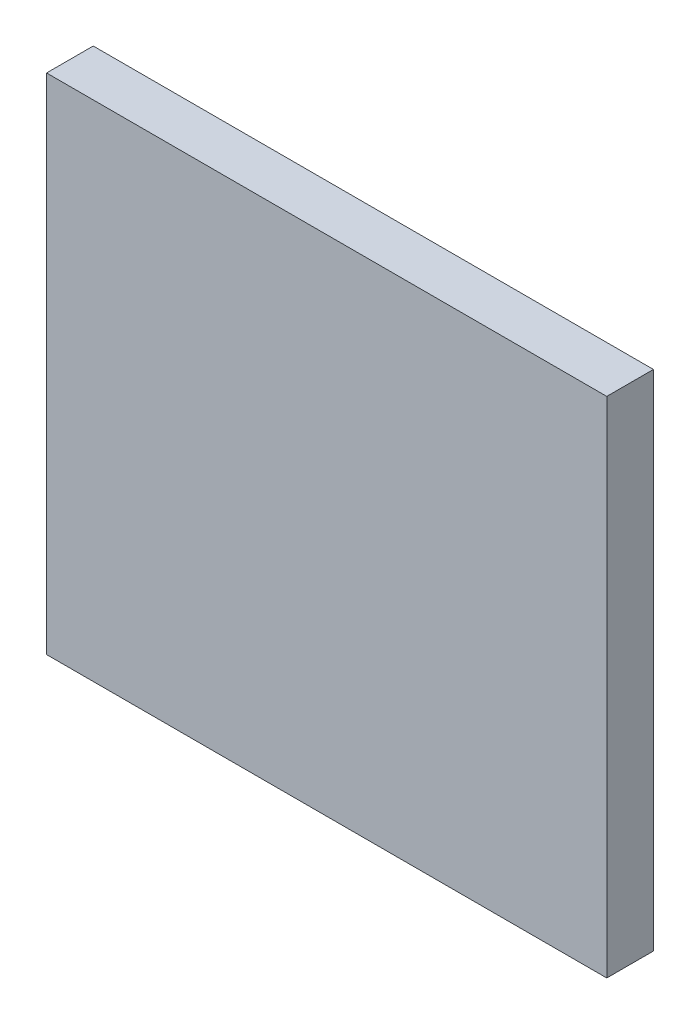
ISO-10303-21;
HEADER;
FILE_DESCRIPTION(('STEP AP214'),'2;1');
FILE_NAME('part.step','',(''),(''),'','','');
FILE_SCHEMA(('AUTOMOTIVE_DESIGN { 1 0 10303 214 1 1 1 1 }'));
ENDSEC;
DATA;
#1=APPLICATION_CONTEXT('core data for automotive mechanical design processes');
#2=APPLICATION_PROTOCOL_DEFINITION('international standard','automotive_design',2000,#1);
#3=PRODUCT_CONTEXT('',#1,'mechanical');
#4=PRODUCT('Part','Part','',(#3));
#5=PRODUCT_RELATED_PRODUCT_CATEGORY('part','',(#4));
#6=PRODUCT_DEFINITION_FORMATION('','',#4);
#7=PRODUCT_DEFINITION_CONTEXT('part definition',#1,'design');
#8=PRODUCT_DEFINITION('design','',#6,#7);
#9=PRODUCT_DEFINITION_SHAPE('','',#8);
#10=(LENGTH_UNIT() NAMED_UNIT(*) SI_UNIT(.MILLI.,.METRE.));
#11=(NAMED_UNIT(*) PLANE_ANGLE_UNIT() SI_UNIT($,.RADIAN.));
#12=(NAMED_UNIT(*) SI_UNIT($,.STERADIAN.) SOLID_ANGLE_UNIT());
#13=UNCERTAINTY_MEASURE_WITH_UNIT(LENGTH_MEASURE(1.E-05),#10,'distance_accuracy_value','');
#14=(GEOMETRIC_REPRESENTATION_CONTEXT(3) GLOBAL_UNCERTAINTY_ASSIGNED_CONTEXT((#13)) GLOBAL_UNIT_ASSIGNED_CONTEXT((#10,
#11,#12)) REPRESENTATION_CONTEXT('',''));
#15=CARTESIAN_POINT('',(0.,0.,0.));
#16=DIRECTION('',(0.,0.,1.));
#17=DIRECTION('',(1.,0.,0.));
#18=AXIS2_PLACEMENT_3D('',#15,#16,#17);
#19=CARTESIAN_POINT('',(-152.4,-53.4724,0.));
#20=DIRECTION('',(1.,0.,0.));
#21=DIRECTION('',(0.,0.,-1.));
#22=AXIS2_PLACEMENT_3D('',#19,#20,#21);
#23=PLANE('',#22);
#24=DIRECTION('',(0.,0.,1.));
#25=VECTOR('',#24,1.);
#26=CARTESIAN_POINT('',(-152.4,-190.5,0.));
#27=LINE('',#26,#25);
#28=CARTESIAN_POINT('',(-152.4,-190.5,0.));
#29=VERTEX_POINT('',#28);
#30=CARTESIAN_POINT('',(-152.4,-190.5,12.6999999999999));
#31=VERTEX_POINT('',#30);
#32=EDGE_CURVE('E146',#29,#31,#27,.T.);
#33=ORIENTED_EDGE('',*,*,#32,.T.);
#34=DIRECTION('',(0.,-1.,0.));
#35=VECTOR('',#34,1.);
#36=CARTESIAN_POINT('',(-152.4,-53.4724,12.6999999999999));
#37=LINE('',#36,#35);
#38=CARTESIAN_POINT('',(-152.4,-53.4724,12.6999999999999));
#39=VERTEX_POINT('',#38);
#40=EDGE_CURVE('E11',#39,#31,#37,.T.);
#41=ORIENTED_EDGE('',*,*,#40,.F.);
#42=DIRECTION('',(0.,0.,1.));
#43=VECTOR('',#42,1.);
#44=CARTESIAN_POINT('',(-152.4,-53.4724,0.));
#45=LINE('',#44,#43);
#46=CARTESIAN_POINT('',(-152.4,-53.4724,0.));
#47=VERTEX_POINT('',#46);
#48=EDGE_CURVE('E147',#47,#39,#45,.T.);
#49=ORIENTED_EDGE('',*,*,#48,.F.);
#50=DIRECTION('',(0.,-1.,0.));
#51=VECTOR('',#50,1.);
#52=CARTESIAN_POINT('',(-152.4,-53.4724,0.));
#53=LINE('',#52,#51);
#54=EDGE_CURVE('E153',#47,#29,#53,.T.);
#55=ORIENTED_EDGE('',*,*,#54,.T.);
#56=EDGE_LOOP('',(#33,#41,#49,#55));
#57=FACE_BOUND('',#56,.T.);
#58=ADVANCED_FACE('F35',(#57),#23,.F.);
#59=CARTESIAN_POINT('',(-152.4,-53.4724,12.6999999999999));
#60=DIRECTION('',(0.,0.,-1.));
#61=DIRECTION('',(-1.,0.,0.));
#62=AXIS2_PLACEMENT_3D('',#59,#60,#61);
#63=PLANE('',#62);
#64=DIRECTION('',(1.,0.,0.));
#65=VECTOR('',#64,1.);
#66=CARTESIAN_POINT('',(-152.4,-190.5,12.6999999999999));
#67=LINE('',#66,#65);
#68=CARTESIAN_POINT('',(1.66533453693773E-13,-190.5,12.7));
#69=VERTEX_POINT('',#68);
#70=EDGE_CURVE('E156',#31,#69,#67,.T.);
#71=ORIENTED_EDGE('',*,*,#70,.T.);
#72=DIRECTION('',(0.,-1.,0.));
#73=VECTOR('',#72,1.);
#74=CARTESIAN_POINT('',(1.66533453693773E-13,-53.4724,12.7));
#75=LINE('',#74,#73);
#76=CARTESIAN_POINT('',(1.66533453693773E-13,-53.4724,12.7));
#77=VERTEX_POINT('',#76);
#78=EDGE_CURVE('E43',#77,#69,#75,.T.);
#79=ORIENTED_EDGE('',*,*,#78,.F.);
#80=DIRECTION('',(1.,0.,0.));
#81=VECTOR('',#80,1.);
#82=CARTESIAN_POINT('',(-152.4,-53.4724,12.6999999999999));
#83=LINE('',#82,#81);
#84=EDGE_CURVE('E82',#39,#77,#83,.T.);
#85=ORIENTED_EDGE('',*,*,#84,.F.);
#86=ORIENTED_EDGE('',*,*,#40,.T.);
#87=EDGE_LOOP('',(#71,#79,#85,#86));
#88=FACE_BOUND('',#87,.T.);
#89=ADVANCED_FACE('F179',(#88),#63,.F.);
#90=CARTESIAN_POINT('',(0.,-53.4724,0.));
#91=DIRECTION('',(-1.,0.,0.));
#92=DIRECTION('',(0.,0.,1.));
#93=AXIS2_PLACEMENT_3D('',#90,#91,#92);
#94=PLANE('',#93);
#95=DIRECTION('',(0.,0.,-1.));
#96=VECTOR('',#95,1.);
#97=CARTESIAN_POINT('',(0.,-190.5,0.));
#98=LINE('',#97,#96);
#99=CARTESIAN_POINT('',(0.,-190.5,0.));
#100=VERTEX_POINT('',#99);
#101=EDGE_CURVE('E69',#69,#100,#98,.T.);
#102=ORIENTED_EDGE('',*,*,#101,.T.);
#103=DIRECTION('',(0.,-1.,0.));
#104=VECTOR('',#103,1.);
#105=CARTESIAN_POINT('',(0.,-53.4724,0.));
#106=LINE('',#105,#104);
#107=CARTESIAN_POINT('',(0.,-53.4724,0.));
#108=VERTEX_POINT('',#107);
#109=EDGE_CURVE('E161',#108,#100,#106,.T.);
#110=ORIENTED_EDGE('',*,*,#109,.F.);
#111=DIRECTION('',(0.,0.,-1.));
#112=VECTOR('',#111,1.);
#113=CARTESIAN_POINT('',(0.,-53.4724,0.));
#114=LINE('',#113,#112);
#115=EDGE_CURVE('E150',#77,#108,#114,.T.);
#116=ORIENTED_EDGE('',*,*,#115,.F.);
#117=ORIENTED_EDGE('',*,*,#78,.T.);
#118=EDGE_LOOP('',(#102,#110,#116,#117));
#119=FACE_BOUND('',#118,.T.);
#120=ADVANCED_FACE('F163',(#119),#94,.F.);
#121=CARTESIAN_POINT('',(-152.4,-53.4724,0.));
#122=DIRECTION('',(0.,0.,1.));
#123=DIRECTION('',(1.,0.,0.));
#124=AXIS2_PLACEMENT_3D('',#121,#122,#123);
#125=PLANE('',#124);
#126=DIRECTION('',(-1.,0.,0.));
#127=VECTOR('',#126,1.);
#128=CARTESIAN_POINT('',(-152.4,-190.5,0.));
#129=LINE('',#128,#127);
#130=EDGE_CURVE('E75',#100,#29,#129,.T.);
#131=ORIENTED_EDGE('',*,*,#130,.T.);
#132=ORIENTED_EDGE('',*,*,#54,.F.);
#133=DIRECTION('',(-1.,0.,0.));
#134=VECTOR('',#133,1.);
#135=CARTESIAN_POINT('',(-152.4,-53.4724,0.));
#136=LINE('',#135,#134);
#137=EDGE_CURVE('E51',#108,#47,#136,.T.);
#138=ORIENTED_EDGE('',*,*,#137,.F.);
#139=ORIENTED_EDGE('',*,*,#109,.T.);
#140=EDGE_LOOP('',(#131,#132,#138,#139));
#141=FACE_BOUND('',#140,.T.);
#142=ADVANCED_FACE('F170',(#141),#125,.F.);
#143=CARTESIAN_POINT('',(0.,-53.4724,0.));
#144=DIRECTION('',(0.,1.,0.));
#145=DIRECTION('',(0.,0.,1.));
#146=AXIS2_PLACEMENT_3D('',#143,#144,#145);
#147=PLANE('',#146);
#148=ORIENTED_EDGE('',*,*,#48,.T.);
#149=ORIENTED_EDGE('',*,*,#84,.T.);
#150=ORIENTED_EDGE('',*,*,#115,.T.);
#151=ORIENTED_EDGE('',*,*,#137,.T.);
#152=EDGE_LOOP('',(#148,#149,#150,#151));
#153=FACE_BOUND('',#152,.T.);
#154=ADVANCED_FACE('F172',(#153),#147,.T.);
#155=CARTESIAN_POINT('',(0.,-190.5,0.));
#156=DIRECTION('',(0.,1.,0.));
#157=DIRECTION('',(0.,0.,1.));
#158=AXIS2_PLACEMENT_3D('',#155,#156,#157);
#159=PLANE('',#158);
#160=CARTESIAN_POINT('',(-139.7,-190.5,6.34999999999997));
#161=DIRECTION('',(0.,-1.,0.));
#162=DIRECTION('',(0.,0.,-1.));
#163=AXIS2_PLACEMENT_3D('',#160,#161,#162);
#164=CIRCLE('',#163,2.55269999999999);
#165=CARTESIAN_POINT('',(-139.7,-190.5,3.79729999999998));
#166=VERTEX_POINT('',#165);
#167=EDGE_CURVE('E112',#166,#166,#164,.T.);
#168=ORIENTED_EDGE('',*,*,#167,.F.);
#169=EDGE_LOOP('',(#168));
#170=FACE_BOUND('',#169,.T.);
#171=CARTESIAN_POINT('',(-114.3,-190.5,6.35000000000014));
#172=DIRECTION('',(0.,-1.,0.));
#173=DIRECTION('',(0.,0.,-1.));
#174=AXIS2_PLACEMENT_3D('',#171,#172,#173);
#175=CIRCLE('',#174,2.55269999999999);
#176=CARTESIAN_POINT('',(-114.3,-190.5,3.79730000000015));
#177=VERTEX_POINT('',#176);
#178=EDGE_CURVE('E111',#177,#177,#175,.T.);
#179=ORIENTED_EDGE('',*,*,#178,.F.);
#180=EDGE_LOOP('',(#179));
#181=FACE_BOUND('',#180,.T.);
#182=CARTESIAN_POINT('',(-88.9,-190.5,6.35000000000032));
#183=DIRECTION('',(0.,-1.,0.));
#184=DIRECTION('',(0.,0.,-1.));
#185=AXIS2_PLACEMENT_3D('',#182,#183,#184);
#186=CIRCLE('',#185,2.55269999999999);
#187=CARTESIAN_POINT('',(-88.9,-190.5,3.79730000000033));
#188=VERTEX_POINT('',#187);
#189=EDGE_CURVE('E122',#188,#188,#186,.T.);
#190=ORIENTED_EDGE('',*,*,#189,.F.);
#191=EDGE_LOOP('',(#190));
#192=FACE_BOUND('',#191,.T.);
#193=CARTESIAN_POINT('',(-63.5,-190.5,6.3500000000005));
#194=DIRECTION('',(0.,-1.,0.));
#195=DIRECTION('',(0.,0.,-1.));
#196=AXIS2_PLACEMENT_3D('',#193,#194,#195);
#197=CIRCLE('',#196,2.55269999999999);
#198=CARTESIAN_POINT('',(-63.5,-190.5,3.79730000000051));
#199=VERTEX_POINT('',#198);
#200=EDGE_CURVE('E128',#199,#199,#197,.T.);
#201=ORIENTED_EDGE('',*,*,#200,.F.);
#202=EDGE_LOOP('',(#201));
#203=FACE_BOUND('',#202,.T.);
#204=CARTESIAN_POINT('',(-38.1,-190.5,6.35000000000068));
#205=DIRECTION('',(0.,-1.,0.));
#206=DIRECTION('',(0.,0.,-1.));
#207=AXIS2_PLACEMENT_3D('',#204,#205,#206);
#208=CIRCLE('',#207,2.55269999999999);
#209=CARTESIAN_POINT('',(-38.1,-190.5,3.79730000000069));
#210=VERTEX_POINT('',#209);
#211=EDGE_CURVE('E134',#210,#210,#208,.T.);
#212=ORIENTED_EDGE('',*,*,#211,.F.);
#213=EDGE_LOOP('',(#212));
#214=FACE_BOUND('',#213,.T.);
#215=CARTESIAN_POINT('',(-12.7,-190.5,6.35000000000085));
#216=DIRECTION('',(0.,-1.,0.));
#217=DIRECTION('',(0.,0.,-1.));
#218=AXIS2_PLACEMENT_3D('',#215,#216,#217);
#219=CIRCLE('',#218,2.55269999999999);
#220=CARTESIAN_POINT('',(-12.7,-190.5,3.79730000000086));
#221=VERTEX_POINT('',#220);
#222=EDGE_CURVE('E140',#221,#221,#219,.T.);
#223=ORIENTED_EDGE('',*,*,#222,.F.);
#224=EDGE_LOOP('',(#223));
#225=FACE_BOUND('',#224,.T.);
#226=ORIENTED_EDGE('',*,*,#32,.F.);
#227=ORIENTED_EDGE('',*,*,#130,.F.);
#228=ORIENTED_EDGE('',*,*,#101,.F.);
#229=ORIENTED_EDGE('',*,*,#70,.F.);
#230=EDGE_LOOP('',(#226,#227,#228,#229));
#231=FACE_BOUND('',#230,.T.);
#232=ADVANCED_FACE('F166',(#170,#181,#192,#203,#214,#225,#231),#159,.F.);
#233=CARTESIAN_POINT('',(-12.7,-170.5,6.35000000000085));
#234=DIRECTION('',(0.,-1.,0.));
#235=DIRECTION('',(0.,0.,-1.));
#236=AXIS2_PLACEMENT_3D('',#233,#234,#235);
#237=CONICAL_SURFACE('',#236,2.5527,1.02974425867665);
#238=CARTESIAN_POINT('',(-12.7,-168.966183097808,6.35000000000085));
#239=VERTEX_POINT('',#238);
#240=VERTEX_LOOP('',#239);
#241=FACE_BOUND('',#240,.T.);
#242=CARTESIAN_POINT('',(-12.7,-170.5,6.35000000000085));
#243=DIRECTION('',(0.,-1.,0.));
#244=DIRECTION('',(0.,0.,-1.));
#245=AXIS2_PLACEMENT_3D('',#242,#243,#244);
#246=CIRCLE('',#245,2.5527);
#247=CARTESIAN_POINT('',(-12.7,-170.5,3.79730000000086));
#248=VERTEX_POINT('',#247);
#249=EDGE_CURVE('E143',#248,#248,#246,.T.);
#250=ORIENTED_EDGE('',*,*,#249,.T.);
#251=EDGE_LOOP('',(#250));
#252=FACE_BOUND('',#251,.T.);
#253=ADVANCED_FACE('F211',(#241,#252),#237,.F.);
#254=CARTESIAN_POINT('',(-12.7,-190.5,6.35000000000085));
#255=DIRECTION('',(0.,-1.,0.));
#256=DIRECTION('',(0.,0.,-1.));
#257=AXIS2_PLACEMENT_3D('',#254,#255,#256);
#258=CYLINDRICAL_SURFACE('',#257,2.55269999999999);
#259=ORIENTED_EDGE('',*,*,#249,.F.);
#260=EDGE_LOOP('',(#259));
#261=FACE_BOUND('',#260,.T.);
#262=ORIENTED_EDGE('',*,*,#222,.T.);
#263=EDGE_LOOP('',(#262));
#264=FACE_BOUND('',#263,.T.);
#265=ADVANCED_FACE('F220',(#261,#264),#258,.F.);
#266=CARTESIAN_POINT('',(-38.1,-170.5,6.35000000000068));
#267=DIRECTION('',(0.,-1.,0.));
#268=DIRECTION('',(0.,0.,-1.));
#269=AXIS2_PLACEMENT_3D('',#266,#267,#268);
#270=CONICAL_SURFACE('',#269,2.5527,1.02974425867665);
#271=CARTESIAN_POINT('',(-38.1,-168.966183097808,6.35000000000068));
#272=VERTEX_POINT('',#271);
#273=VERTEX_LOOP('',#272);
#274=FACE_BOUND('',#273,.T.);
#275=CARTESIAN_POINT('',(-38.1,-170.5,6.35000000000068));
#276=DIRECTION('',(0.,-1.,0.));
#277=DIRECTION('',(0.,0.,-1.));
#278=AXIS2_PLACEMENT_3D('',#275,#276,#277);
#279=CIRCLE('',#278,2.5527);
#280=CARTESIAN_POINT('',(-38.1,-170.5,3.79730000000068));
#281=VERTEX_POINT('',#280);
#282=EDGE_CURVE('E137',#281,#281,#279,.T.);
#283=ORIENTED_EDGE('',*,*,#282,.T.);
#284=EDGE_LOOP('',(#283));
#285=FACE_BOUND('',#284,.T.);
#286=ADVANCED_FACE('F230',(#274,#285),#270,.F.);
#287=CARTESIAN_POINT('',(-38.1,-190.5,6.35000000000068));
#288=DIRECTION('',(0.,-1.,0.));
#289=DIRECTION('',(0.,0.,-1.));
#290=AXIS2_PLACEMENT_3D('',#287,#288,#289);
#291=CYLINDRICAL_SURFACE('',#290,2.55269999999999);
#292=ORIENTED_EDGE('',*,*,#282,.F.);
#293=EDGE_LOOP('',(#292));
#294=FACE_BOUND('',#293,.T.);
#295=ORIENTED_EDGE('',*,*,#211,.T.);
#296=EDGE_LOOP('',(#295));
#297=FACE_BOUND('',#296,.T.);
#298=ADVANCED_FACE('F240',(#294,#297),#291,.F.);
#299=CARTESIAN_POINT('',(-63.5,-170.5,6.3500000000005));
#300=DIRECTION('',(0.,-1.,0.));
#301=DIRECTION('',(0.,0.,-1.));
#302=AXIS2_PLACEMENT_3D('',#299,#300,#301);
#303=CONICAL_SURFACE('',#302,2.5527,1.02974425867665);
#304=CARTESIAN_POINT('',(-63.5,-168.966183097808,6.3500000000005));
#305=VERTEX_POINT('',#304);
#306=VERTEX_LOOP('',#305);
#307=FACE_BOUND('',#306,.T.);
#308=CARTESIAN_POINT('',(-63.5,-170.5,6.3500000000005));
#309=DIRECTION('',(0.,-1.,0.));
#310=DIRECTION('',(0.,0.,-1.));
#311=AXIS2_PLACEMENT_3D('',#308,#309,#310);
#312=CIRCLE('',#311,2.5527);
#313=CARTESIAN_POINT('',(-63.5,-170.5,3.7973000000005));
#314=VERTEX_POINT('',#313);
#315=EDGE_CURVE('E131',#314,#314,#312,.T.);
#316=ORIENTED_EDGE('',*,*,#315,.T.);
#317=EDGE_LOOP('',(#316));
#318=FACE_BOUND('',#317,.T.);
#319=ADVANCED_FACE('F250',(#307,#318),#303,.F.);
#320=CARTESIAN_POINT('',(-63.5,-190.5,6.3500000000005));
#321=DIRECTION('',(0.,-1.,0.));
#322=DIRECTION('',(0.,0.,-1.));
#323=AXIS2_PLACEMENT_3D('',#320,#321,#322);
#324=CYLINDRICAL_SURFACE('',#323,2.55269999999999);
#325=ORIENTED_EDGE('',*,*,#315,.F.);
#326=EDGE_LOOP('',(#325));
#327=FACE_BOUND('',#326,.T.);
#328=ORIENTED_EDGE('',*,*,#200,.T.);
#329=EDGE_LOOP('',(#328));
#330=FACE_BOUND('',#329,.T.);
#331=ADVANCED_FACE('F260',(#327,#330),#324,.F.);
#332=CARTESIAN_POINT('',(-88.9,-170.5,6.35000000000032));
#333=DIRECTION('',(0.,-1.,0.));
#334=DIRECTION('',(0.,0.,-1.));
#335=AXIS2_PLACEMENT_3D('',#332,#333,#334);
#336=CONICAL_SURFACE('',#335,2.55269999999999,1.02974425867665);
#337=CARTESIAN_POINT('',(-88.9,-168.966183097808,6.35000000000032));
#338=VERTEX_POINT('',#337);
#339=VERTEX_LOOP('',#338);
#340=FACE_BOUND('',#339,.T.);
#341=CARTESIAN_POINT('',(-88.9,-170.5,6.35000000000032));
#342=DIRECTION('',(0.,-1.,0.));
#343=DIRECTION('',(0.,0.,-1.));
#344=AXIS2_PLACEMENT_3D('',#341,#342,#343);
#345=CIRCLE('',#344,2.55269999999999);
#346=CARTESIAN_POINT('',(-88.9,-170.5,3.79730000000033));
#347=VERTEX_POINT('',#346);
#348=EDGE_CURVE('E125',#347,#347,#345,.T.);
#349=ORIENTED_EDGE('',*,*,#348,.T.);
#350=EDGE_LOOP('',(#349));
#351=FACE_BOUND('',#350,.T.);
#352=ADVANCED_FACE('F270',(#340,#351),#336,.F.);
#353=CARTESIAN_POINT('',(-88.9,-190.5,6.35000000000032));
#354=DIRECTION('',(0.,-1.,0.));
#355=DIRECTION('',(0.,0.,-1.));
#356=AXIS2_PLACEMENT_3D('',#353,#354,#355);
#357=CYLINDRICAL_SURFACE('',#356,2.55269999999999);
#358=ORIENTED_EDGE('',*,*,#348,.F.);
#359=EDGE_LOOP('',(#358));
#360=FACE_BOUND('',#359,.T.);
#361=ORIENTED_EDGE('',*,*,#189,.T.);
#362=EDGE_LOOP('',(#361));
#363=FACE_BOUND('',#362,.T.);
#364=ADVANCED_FACE('F280',(#360,#363),#357,.F.);
#365=CARTESIAN_POINT('',(-114.3,-170.5,6.35000000000014));
#366=DIRECTION('',(0.,-1.,0.));
#367=DIRECTION('',(0.,0.,-1.));
#368=AXIS2_PLACEMENT_3D('',#365,#366,#367);
#369=CONICAL_SURFACE('',#368,2.55269999999999,1.02974425867665);
#370=CARTESIAN_POINT('',(-114.3,-168.966183097808,6.35000000000014));
#371=VERTEX_POINT('',#370);
#372=VERTEX_LOOP('',#371);
#373=FACE_BOUND('',#372,.T.);
#374=CARTESIAN_POINT('',(-114.3,-170.5,6.35000000000014));
#375=DIRECTION('',(0.,-1.,0.));
#376=DIRECTION('',(0.,0.,-1.));
#377=AXIS2_PLACEMENT_3D('',#374,#375,#376);
#378=CIRCLE('',#377,2.55269999999999);
#379=CARTESIAN_POINT('',(-114.3,-170.5,3.79730000000015));
#380=VERTEX_POINT('',#379);
#381=EDGE_CURVE('E115',#380,#380,#378,.T.);
#382=ORIENTED_EDGE('',*,*,#381,.T.);
#383=EDGE_LOOP('',(#382));
#384=FACE_BOUND('',#383,.T.);
#385=ADVANCED_FACE('F291',(#373,#384),#369,.F.);
#386=CARTESIAN_POINT('',(-114.3,-190.5,6.35000000000014));
#387=DIRECTION('',(0.,-1.,0.));
#388=DIRECTION('',(0.,0.,-1.));
#389=AXIS2_PLACEMENT_3D('',#386,#387,#388);
#390=CYLINDRICAL_SURFACE('',#389,2.55269999999999);
#391=ORIENTED_EDGE('',*,*,#381,.F.);
#392=EDGE_LOOP('',(#391));
#393=FACE_BOUND('',#392,.T.);
#394=ORIENTED_EDGE('',*,*,#178,.T.);
#395=EDGE_LOOP('',(#394));
#396=FACE_BOUND('',#395,.T.);
#397=ADVANCED_FACE('F105',(#393,#396),#390,.F.);
#398=CARTESIAN_POINT('',(-139.7,-170.5,6.34999999999997));
#399=DIRECTION('',(0.,-1.,0.));
#400=DIRECTION('',(0.,0.,-1.));
#401=AXIS2_PLACEMENT_3D('',#398,#399,#400);
#402=CONICAL_SURFACE('',#401,2.55269999999999,1.02974425867665);
#403=CARTESIAN_POINT('',(-139.7,-168.966183097808,6.34999999999997));
#404=VERTEX_POINT('',#403);
#405=VERTEX_LOOP('',#404);
#406=FACE_BOUND('',#405,.T.);
#407=CARTESIAN_POINT('',(-139.7,-170.5,6.34999999999997));
#408=DIRECTION('',(0.,-1.,0.));
#409=DIRECTION('',(0.,0.,-1.));
#410=AXIS2_PLACEMENT_3D('',#407,#408,#409);
#411=CIRCLE('',#410,2.55269999999999);
#412=CARTESIAN_POINT('',(-139.7,-170.5,3.79729999999998));
#413=VERTEX_POINT('',#412);
#414=EDGE_CURVE('E109',#413,#413,#411,.T.);
#415=ORIENTED_EDGE('',*,*,#414,.T.);
#416=EDGE_LOOP('',(#415));
#417=FACE_BOUND('',#416,.T.);
#418=ADVANCED_FACE('F101',(#406,#417),#402,.F.);
#419=CARTESIAN_POINT('',(-139.7,-190.5,6.34999999999997));
#420=DIRECTION('',(0.,-1.,0.));
#421=DIRECTION('',(0.,0.,-1.));
#422=AXIS2_PLACEMENT_3D('',#419,#420,#421);
#423=CYLINDRICAL_SURFACE('',#422,2.55269999999999);
#424=ORIENTED_EDGE('',*,*,#414,.F.);
#425=EDGE_LOOP('',(#424));
#426=FACE_BOUND('',#425,.T.);
#427=ORIENTED_EDGE('',*,*,#167,.T.);
#428=EDGE_LOOP('',(#427));
#429=FACE_BOUND('',#428,.T.);
#430=ADVANCED_FACE('F104',(#426,#429),#423,.F.);
#431=CLOSED_SHELL('',(#58,#89,#120,#142,#154,#232,#253,#265,#286,#298,#319,#331,#352,#364,#385,
#397,#418,#430));
#432=MANIFOLD_SOLID_BREP('B2',#431);
#433=ADVANCED_BREP_SHAPE_REPRESENTATION('',(#18,#432),#14);
#434=SHAPE_DEFINITION_REPRESENTATION(#9,#433);
ENDSEC;
END-ISO-10303-21;
